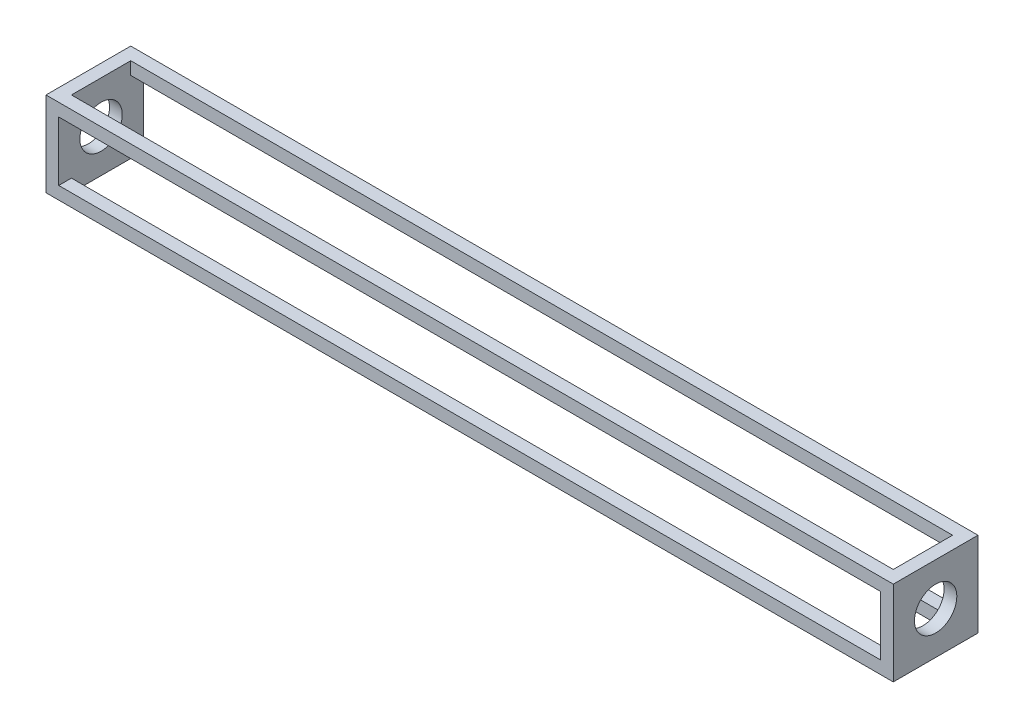
ISO-10303-21;
HEADER;
FILE_DESCRIPTION(('STEP AP214'),'2;1');
FILE_NAME('part.step','',(''),(''),'','','');
FILE_SCHEMA(('AUTOMOTIVE_DESIGN { 1 0 10303 214 1 1 1 1 }'));
ENDSEC;
DATA;
#1=APPLICATION_CONTEXT('core data for automotive mechanical design processes');
#2=APPLICATION_PROTOCOL_DEFINITION('international standard','automotive_design',2000,#1);
#3=PRODUCT_CONTEXT('',#1,'mechanical');
#4=PRODUCT('Part','Part','',(#3));
#5=PRODUCT_RELATED_PRODUCT_CATEGORY('part','',(#4));
#6=PRODUCT_DEFINITION_FORMATION('','',#4);
#7=PRODUCT_DEFINITION_CONTEXT('part definition',#1,'design');
#8=PRODUCT_DEFINITION('design','',#6,#7);
#9=PRODUCT_DEFINITION_SHAPE('','',#8);
#10=(LENGTH_UNIT() NAMED_UNIT(*) SI_UNIT(.MILLI.,.METRE.));
#11=(NAMED_UNIT(*) PLANE_ANGLE_UNIT() SI_UNIT($,.RADIAN.));
#12=(NAMED_UNIT(*) SI_UNIT($,.STERADIAN.) SOLID_ANGLE_UNIT());
#13=UNCERTAINTY_MEASURE_WITH_UNIT(LENGTH_MEASURE(1.E-05),#10,'distance_accuracy_value','');
#14=(GEOMETRIC_REPRESENTATION_CONTEXT(3) GLOBAL_UNCERTAINTY_ASSIGNED_CONTEXT((#13)) GLOBAL_UNIT_ASSIGNED_CONTEXT((#10,
#11,#12)) REPRESENTATION_CONTEXT('',''));
#15=CARTESIAN_POINT('',(0.,0.,0.));
#16=DIRECTION('',(0.,0.,1.));
#17=DIRECTION('',(1.,0.,0.));
#18=AXIS2_PLACEMENT_3D('',#15,#16,#17);
#19=CARTESIAN_POINT('',(0.,3.,20.));
#20=DIRECTION('',(0.,1.,0.));
#21=DIRECTION('',(0.,0.,1.));
#22=AXIS2_PLACEMENT_3D('',#19,#20,#21);
#23=PLANE('',#22);
#24=DIRECTION('',(1.,0.,0.));
#25=VECTOR('',#24,1.);
#26=CARTESIAN_POINT('',(0.,3.,17.));
#27=LINE('',#26,#25);
#28=CARTESIAN_POINT('',(3.,3.,17.));
#29=VERTEX_POINT('',#28);
#30=CARTESIAN_POINT('',(197.,3.,17.));
#31=VERTEX_POINT('',#30);
#32=EDGE_CURVE('E240',#29,#31,#27,.T.);
#33=ORIENTED_EDGE('',*,*,#32,.F.);
#34=DIRECTION('',(0.,0.,-1.));
#35=VECTOR('',#34,1.);
#36=CARTESIAN_POINT('',(3.,3.,20.));
#37=LINE('',#36,#35);
#38=CARTESIAN_POINT('',(3.,3.,20.));
#39=VERTEX_POINT('',#38);
#40=EDGE_CURVE('E178',#39,#29,#37,.T.);
#41=ORIENTED_EDGE('',*,*,#40,.F.);
#42=DIRECTION('',(1.,0.,0.));
#43=VECTOR('',#42,1.);
#44=CARTESIAN_POINT('',(3.,3.,20.));
#45=LINE('',#44,#43);
#46=CARTESIAN_POINT('',(197.,3.,20.));
#47=VERTEX_POINT('',#46);
#48=EDGE_CURVE('E228',#39,#47,#45,.T.);
#49=ORIENTED_EDGE('',*,*,#48,.T.);
#50=DIRECTION('',(0.,0.,-1.));
#51=VECTOR('',#50,1.);
#52=CARTESIAN_POINT('',(197.,3.,20.));
#53=LINE('',#52,#51);
#54=EDGE_CURVE('E182',#47,#31,#53,.T.);
#55=ORIENTED_EDGE('',*,*,#54,.T.);
#56=EDGE_LOOP('',(#33,#41,#49,#55));
#57=FACE_BOUND('',#56,.T.);
#58=ADVANCED_FACE('F19',(#57),#23,.T.);
#59=CARTESIAN_POINT('',(0.,17.,20.));
#60=DIRECTION('',(0.,-1.,0.));
#61=DIRECTION('',(0.,0.,-1.));
#62=AXIS2_PLACEMENT_3D('',#59,#60,#61);
#63=PLANE('',#62);
#64=DIRECTION('',(-1.,0.,0.));
#65=VECTOR('',#64,1.);
#66=CARTESIAN_POINT('',(0.,17.,17.));
#67=LINE('',#66,#65);
#68=CARTESIAN_POINT('',(197.,17.,17.));
#69=VERTEX_POINT('',#68);
#70=CARTESIAN_POINT('',(3.,17.,17.));
#71=VERTEX_POINT('',#70);
#72=EDGE_CURVE('E242',#69,#71,#67,.T.);
#73=ORIENTED_EDGE('',*,*,#72,.F.);
#74=DIRECTION('',(0.,0.,-1.));
#75=VECTOR('',#74,1.);
#76=CARTESIAN_POINT('',(197.,17.,20.));
#77=LINE('',#76,#75);
#78=CARTESIAN_POINT('',(197.,17.,20.));
#79=VERTEX_POINT('',#78);
#80=EDGE_CURVE('E168',#79,#69,#77,.T.);
#81=ORIENTED_EDGE('',*,*,#80,.F.);
#82=DIRECTION('',(-1.,0.,0.));
#83=VECTOR('',#82,1.);
#84=CARTESIAN_POINT('',(197.,17.,20.));
#85=LINE('',#84,#83);
#86=CARTESIAN_POINT('',(3.,17.,20.));
#87=VERTEX_POINT('',#86);
#88=EDGE_CURVE('E234',#79,#87,#85,.T.);
#89=ORIENTED_EDGE('',*,*,#88,.T.);
#90=DIRECTION('',(0.,0.,-1.));
#91=VECTOR('',#90,1.);
#92=CARTESIAN_POINT('',(3.,17.,20.));
#93=LINE('',#92,#91);
#94=EDGE_CURVE('E174',#87,#71,#93,.T.);
#95=ORIENTED_EDGE('',*,*,#94,.T.);
#96=EDGE_LOOP('',(#73,#81,#89,#95));
#97=FACE_BOUND('',#96,.T.);
#98=ADVANCED_FACE('F270',(#97),#63,.T.);
#99=CARTESIAN_POINT('',(0.,20.,20.));
#100=DIRECTION('',(0.,0.,-1.));
#101=DIRECTION('',(-1.,0.,0.));
#102=AXIS2_PLACEMENT_3D('',#99,#100,#101);
#103=PLANE('',#102);
#104=DIRECTION('',(0.,-1.,0.));
#105=VECTOR('',#104,1.);
#106=CARTESIAN_POINT('',(0.,0.,20.));
#107=LINE('',#106,#105);
#108=CARTESIAN_POINT('',(0.,20.,20.));
#109=VERTEX_POINT('',#108);
#110=CARTESIAN_POINT('',(0.,0.,20.));
#111=VERTEX_POINT('',#110);
#112=EDGE_CURVE('E203',#109,#111,#107,.T.);
#113=ORIENTED_EDGE('',*,*,#112,.T.);
#114=DIRECTION('',(1.,0.,0.));
#115=VECTOR('',#114,1.);
#116=CARTESIAN_POINT('',(0.,0.,20.));
#117=LINE('',#116,#115);
#118=CARTESIAN_POINT('',(200.,0.,20.));
#119=VERTEX_POINT('',#118);
#120=EDGE_CURVE('E214',#111,#119,#117,.T.);
#121=ORIENTED_EDGE('',*,*,#120,.T.);
#122=DIRECTION('',(0.,1.,0.));
#123=VECTOR('',#122,1.);
#124=CARTESIAN_POINT('',(200.,0.,20.));
#125=LINE('',#124,#123);
#126=CARTESIAN_POINT('',(200.,20.,20.));
#127=VERTEX_POINT('',#126);
#128=EDGE_CURVE('E212',#119,#127,#125,.T.);
#129=ORIENTED_EDGE('',*,*,#128,.T.);
#130=DIRECTION('',(-1.,0.,0.));
#131=VECTOR('',#130,1.);
#132=CARTESIAN_POINT('',(0.,20.,20.));
#133=LINE('',#132,#131);
#134=EDGE_CURVE('E200',#127,#109,#133,.T.);
#135=ORIENTED_EDGE('',*,*,#134,.T.);
#136=EDGE_LOOP('',(#113,#121,#129,#135));
#137=FACE_BOUND('',#136,.T.);
#138=ORIENTED_EDGE('',*,*,#88,.F.);
#139=DIRECTION('',(0.,1.,0.));
#140=VECTOR('',#139,1.);
#141=CARTESIAN_POINT('',(197.,3.,20.));
#142=LINE('',#141,#140);
#143=EDGE_CURVE('E223',#47,#79,#142,.T.);
#144=ORIENTED_EDGE('',*,*,#143,.F.);
#145=ORIENTED_EDGE('',*,*,#48,.F.);
#146=DIRECTION('',(0.,-1.,0.));
#147=VECTOR('',#146,1.);
#148=CARTESIAN_POINT('',(3.,17.,20.));
#149=LINE('',#148,#147);
#150=EDGE_CURVE('E231',#87,#39,#149,.T.);
#151=ORIENTED_EDGE('',*,*,#150,.F.);
#152=EDGE_LOOP('',(#138,#144,#145,#151));
#153=FACE_BOUND('',#152,.T.);
#154=ADVANCED_FACE('F280',(#137,#153),#103,.F.);
#155=CARTESIAN_POINT('',(0.,20.,0.));
#156=DIRECTION('',(0.,0.,-1.));
#157=DIRECTION('',(-1.,0.,0.));
#158=AXIS2_PLACEMENT_3D('',#155,#156,#157);
#159=PLANE('',#158);
#160=DIRECTION('',(0.,-1.,0.));
#161=VECTOR('',#160,1.);
#162=CARTESIAN_POINT('',(0.,0.,0.));
#163=LINE('',#162,#161);
#164=CARTESIAN_POINT('',(0.,20.,0.));
#165=VERTEX_POINT('',#164);
#166=CARTESIAN_POINT('',(0.,0.,0.));
#167=VERTEX_POINT('',#166);
#168=EDGE_CURVE('E208',#165,#167,#163,.T.);
#169=ORIENTED_EDGE('',*,*,#168,.F.);
#170=DIRECTION('',(-1.,0.,0.));
#171=VECTOR('',#170,1.);
#172=CARTESIAN_POINT('',(0.,20.,0.));
#173=LINE('',#172,#171);
#174=CARTESIAN_POINT('',(200.,20.,0.));
#175=VERTEX_POINT('',#174);
#176=EDGE_CURVE('E201',#175,#165,#173,.T.);
#177=ORIENTED_EDGE('',*,*,#176,.F.);
#178=DIRECTION('',(0.,1.,0.));
#179=VECTOR('',#178,1.);
#180=CARTESIAN_POINT('',(200.,0.,0.));
#181=LINE('',#180,#179);
#182=CARTESIAN_POINT('',(200.,0.,0.));
#183=VERTEX_POINT('',#182);
#184=EDGE_CURVE('E204',#183,#175,#181,.T.);
#185=ORIENTED_EDGE('',*,*,#184,.F.);
#186=DIRECTION('',(1.,0.,0.));
#187=VECTOR('',#186,1.);
#188=CARTESIAN_POINT('',(0.,0.,0.));
#189=LINE('',#188,#187);
#190=EDGE_CURVE('E206',#167,#183,#189,.T.);
#191=ORIENTED_EDGE('',*,*,#190,.F.);
#192=EDGE_LOOP('',(#169,#177,#185,#191));
#193=FACE_BOUND('',#192,.T.);
#194=DIRECTION('',(0.,1.,0.));
#195=VECTOR('',#194,1.);
#196=CARTESIAN_POINT('',(197.,20.,0.));
#197=LINE('',#196,#195);
#198=CARTESIAN_POINT('',(197.,3.,0.));
#199=VERTEX_POINT('',#198);
#200=CARTESIAN_POINT('',(197.,17.,0.));
#201=VERTEX_POINT('',#200);
#202=EDGE_CURVE('E165',#199,#201,#197,.T.);
#203=ORIENTED_EDGE('',*,*,#202,.T.);
#204=DIRECTION('',(-1.,0.,0.));
#205=VECTOR('',#204,1.);
#206=CARTESIAN_POINT('',(0.,17.,0.));
#207=LINE('',#206,#205);
#208=CARTESIAN_POINT('',(3.,17.,0.));
#209=VERTEX_POINT('',#208);
#210=EDGE_CURVE('E138',#201,#209,#207,.T.);
#211=ORIENTED_EDGE('',*,*,#210,.T.);
#212=DIRECTION('',(0.,-1.,0.));
#213=VECTOR('',#212,1.);
#214=CARTESIAN_POINT('',(3.,20.,0.));
#215=LINE('',#214,#213);
#216=CARTESIAN_POINT('',(3.,3.,0.));
#217=VERTEX_POINT('',#216);
#218=EDGE_CURVE('E159',#209,#217,#215,.T.);
#219=ORIENTED_EDGE('',*,*,#218,.T.);
#220=DIRECTION('',(1.,0.,0.));
#221=VECTOR('',#220,1.);
#222=CARTESIAN_POINT('',(0.,3.,0.));
#223=LINE('',#222,#221);
#224=EDGE_CURVE('E162',#217,#199,#223,.T.);
#225=ORIENTED_EDGE('',*,*,#224,.T.);
#226=EDGE_LOOP('',(#203,#211,#219,#225));
#227=FACE_BOUND('',#226,.T.);
#228=ADVANCED_FACE('F295',(#193,#227),#159,.T.);
#229=CARTESIAN_POINT('',(3.,0.,20.));
#230=DIRECTION('',(1.,0.,0.));
#231=DIRECTION('',(0.,0.,-1.));
#232=AXIS2_PLACEMENT_3D('',#229,#230,#231);
#233=PLANE('',#232);
#234=CARTESIAN_POINT('',(3.,17.,3.));
#235=VERTEX_POINT('',#234);
#236=EDGE_CURVE('E147',#235,#209,#93,.T.);
#237=ORIENTED_EDGE('',*,*,#236,.F.);
#238=DIRECTION('',(0.,-1.,0.));
#239=VECTOR('',#238,1.);
#240=CARTESIAN_POINT('',(3.,37.,3.));
#241=LINE('',#240,#239);
#242=CARTESIAN_POINT('',(3.,20.,3.));
#243=VERTEX_POINT('',#242);
#244=EDGE_CURVE('E42',#243,#235,#241,.T.);
#245=ORIENTED_EDGE('',*,*,#244,.F.);
#246=DIRECTION('',(0.,0.,-1.));
#247=VECTOR('',#246,1.);
#248=CARTESIAN_POINT('',(3.,20.,20.));
#249=LINE('',#248,#247);
#250=CARTESIAN_POINT('',(3.,20.,17.));
#251=VERTEX_POINT('',#250);
#252=EDGE_CURVE('E11',#251,#243,#249,.T.);
#253=ORIENTED_EDGE('',*,*,#252,.F.);
#254=DIRECTION('',(0.,-1.,0.));
#255=VECTOR('',#254,1.);
#256=CARTESIAN_POINT('',(3.,37.,17.));
#257=LINE('',#256,#255);
#258=EDGE_CURVE('E256',#251,#71,#257,.T.);
#259=ORIENTED_EDGE('',*,*,#258,.T.);
#260=ORIENTED_EDGE('',*,*,#94,.F.);
#261=ORIENTED_EDGE('',*,*,#150,.T.);
#262=ORIENTED_EDGE('',*,*,#40,.T.);
#263=CARTESIAN_POINT('',(3.,0.,17.));
#264=VERTEX_POINT('',#263);
#265=EDGE_CURVE('E263',#29,#264,#257,.T.);
#266=ORIENTED_EDGE('',*,*,#265,.T.);
#267=DIRECTION('',(0.,0.,1.));
#268=VECTOR('',#267,1.);
#269=CARTESIAN_POINT('',(3.,0.,20.));
#270=LINE('',#269,#268);
#271=CARTESIAN_POINT('',(3.,0.,3.));
#272=VERTEX_POINT('',#271);
#273=EDGE_CURVE('E237',#272,#264,#270,.T.);
#274=ORIENTED_EDGE('',*,*,#273,.F.);
#275=CARTESIAN_POINT('',(3.,3.,3.));
#276=VERTEX_POINT('',#275);
#277=EDGE_CURVE('E148',#276,#272,#241,.T.);
#278=ORIENTED_EDGE('',*,*,#277,.F.);
#279=EDGE_CURVE('E177',#276,#217,#37,.T.);
#280=ORIENTED_EDGE('',*,*,#279,.T.);
#281=ORIENTED_EDGE('',*,*,#218,.F.);
#282=EDGE_LOOP('',(#237,#245,#253,#259,#260,#261,#262,#266,#274,#278,#280,#281));
#283=FACE_BOUND('',#282,.T.);
#284=CARTESIAN_POINT('',(3.,10.,10.));
#285=DIRECTION('',(1.,0.,0.));
#286=DIRECTION('',(0.,0.,-1.));
#287=AXIS2_PLACEMENT_3D('',#284,#285,#286);
#288=CIRCLE('',#287,5.);
#289=CARTESIAN_POINT('',(3.,10.,5.));
#290=VERTEX_POINT('',#289);
#291=EDGE_CURVE('E172',#290,#290,#288,.T.);
#292=ORIENTED_EDGE('',*,*,#291,.F.);
#293=EDGE_LOOP('',(#292));
#294=FACE_BOUND('',#293,.T.);
#295=ADVANCED_FACE('F142',(#283,#294),#233,.T.);
#296=DIRECTION('',(-1.,0.,0.));
#297=VECTOR('',#296,1.);
#298=CARTESIAN_POINT('',(0.,3.,3.));
#299=LINE('',#298,#297);
#300=CARTESIAN_POINT('',(197.,3.,3.));
#301=VERTEX_POINT('',#300);
#302=EDGE_CURVE('E250',#301,#276,#299,.T.);
#303=ORIENTED_EDGE('',*,*,#302,.F.);
#304=EDGE_CURVE('E181',#301,#199,#53,.T.);
#305=ORIENTED_EDGE('',*,*,#304,.T.);
#306=ORIENTED_EDGE('',*,*,#224,.F.);
#307=ORIENTED_EDGE('',*,*,#279,.F.);
#308=EDGE_LOOP('',(#303,#305,#306,#307));
#309=FACE_BOUND('',#308,.T.);
#310=ADVANCED_FACE('F292',(#309),#23,.T.);
#311=CARTESIAN_POINT('',(197.,0.,20.));
#312=DIRECTION('',(-1.,0.,0.));
#313=DIRECTION('',(0.,0.,1.));
#314=AXIS2_PLACEMENT_3D('',#311,#312,#313);
#315=PLANE('',#314);
#316=ORIENTED_EDGE('',*,*,#304,.F.);
#317=DIRECTION('',(0.,-1.,0.));
#318=VECTOR('',#317,1.);
#319=CARTESIAN_POINT('',(197.,37.,3.));
#320=LINE('',#319,#318);
#321=CARTESIAN_POINT('',(197.,0.,3.));
#322=VERTEX_POINT('',#321);
#323=EDGE_CURVE('E34',#301,#322,#320,.T.);
#324=ORIENTED_EDGE('',*,*,#323,.T.);
#325=DIRECTION('',(0.,0.,-1.));
#326=VECTOR('',#325,1.);
#327=CARTESIAN_POINT('',(197.,0.,20.));
#328=LINE('',#327,#326);
#329=CARTESIAN_POINT('',(197.,0.,17.));
#330=VERTEX_POINT('',#329);
#331=EDGE_CURVE('E247',#330,#322,#328,.T.);
#332=ORIENTED_EDGE('',*,*,#331,.F.);
#333=DIRECTION('',(0.,-1.,0.));
#334=VECTOR('',#333,1.);
#335=CARTESIAN_POINT('',(197.,37.,17.));
#336=LINE('',#335,#334);
#337=EDGE_CURVE('E259',#31,#330,#336,.T.);
#338=ORIENTED_EDGE('',*,*,#337,.F.);
#339=ORIENTED_EDGE('',*,*,#54,.F.);
#340=ORIENTED_EDGE('',*,*,#143,.T.);
#341=ORIENTED_EDGE('',*,*,#80,.T.);
#342=CARTESIAN_POINT('',(197.,20.,17.));
#343=VERTEX_POINT('',#342);
#344=EDGE_CURVE('E262',#343,#69,#336,.T.);
#345=ORIENTED_EDGE('',*,*,#344,.F.);
#346=DIRECTION('',(0.,0.,1.));
#347=VECTOR('',#346,1.);
#348=CARTESIAN_POINT('',(197.,20.,20.));
#349=LINE('',#348,#347);
#350=CARTESIAN_POINT('',(197.,20.,3.));
#351=VERTEX_POINT('',#350);
#352=EDGE_CURVE('E137',#351,#343,#349,.T.);
#353=ORIENTED_EDGE('',*,*,#352,.F.);
#354=CARTESIAN_POINT('',(197.,17.,3.));
#355=VERTEX_POINT('',#354);
#356=EDGE_CURVE('E133',#351,#355,#320,.T.);
#357=ORIENTED_EDGE('',*,*,#356,.T.);
#358=EDGE_CURVE('E185',#355,#201,#77,.T.);
#359=ORIENTED_EDGE('',*,*,#358,.T.);
#360=ORIENTED_EDGE('',*,*,#202,.F.);
#361=EDGE_LOOP('',(#316,#324,#332,#338,#339,#340,#341,#345,#353,#357,#359,#360));
#362=FACE_BOUND('',#361,.T.);
#363=CARTESIAN_POINT('',(197.,10.,10.));
#364=DIRECTION('',(-1.,0.,0.));
#365=DIRECTION('',(0.,0.,1.));
#366=AXIS2_PLACEMENT_3D('',#363,#364,#365);
#367=CIRCLE('',#366,5.);
#368=CARTESIAN_POINT('',(197.,10.,15.));
#369=VERTEX_POINT('',#368);
#370=EDGE_CURVE('E169',#369,#369,#367,.T.);
#371=ORIENTED_EDGE('',*,*,#370,.F.);
#372=EDGE_LOOP('',(#371));
#373=FACE_BOUND('',#372,.T.);
#374=ADVANCED_FACE('F272',(#362,#373),#315,.T.);
#375=DIRECTION('',(1.,0.,0.));
#376=VECTOR('',#375,1.);
#377=CARTESIAN_POINT('',(0.,17.,3.));
#378=LINE('',#377,#376);
#379=EDGE_CURVE('E252',#235,#355,#378,.T.);
#380=ORIENTED_EDGE('',*,*,#379,.F.);
#381=ORIENTED_EDGE('',*,*,#236,.T.);
#382=ORIENTED_EDGE('',*,*,#210,.F.);
#383=ORIENTED_EDGE('',*,*,#358,.F.);
#384=EDGE_LOOP('',(#380,#381,#382,#383));
#385=FACE_BOUND('',#384,.T.);
#386=ADVANCED_FACE('F21',(#385),#63,.T.);
#387=CARTESIAN_POINT('',(0.,10.,10.));
#388=DIRECTION('',(1.,0.,0.));
#389=DIRECTION('',(0.,0.,-1.));
#390=AXIS2_PLACEMENT_3D('',#387,#388,#389);
#391=CYLINDRICAL_SURFACE('',#390,5.);
#392=ORIENTED_EDGE('',*,*,#370,.T.);
#393=EDGE_LOOP('',(#392));
#394=FACE_BOUND('',#393,.T.);
#395=CARTESIAN_POINT('',(200.,10.,10.));
#396=DIRECTION('',(1.,0.,0.));
#397=DIRECTION('',(0.,0.,-1.));
#398=AXIS2_PLACEMENT_3D('',#395,#396,#397);
#399=CIRCLE('',#398,5.);
#400=CARTESIAN_POINT('',(200.,10.,5.));
#401=VERTEX_POINT('',#400);
#402=EDGE_CURVE('E220',#401,#401,#399,.T.);
#403=ORIENTED_EDGE('',*,*,#402,.T.);
#404=EDGE_LOOP('',(#403));
#405=FACE_BOUND('',#404,.T.);
#406=ADVANCED_FACE('F300',(#394,#405),#391,.F.);
#407=ORIENTED_EDGE('',*,*,#291,.T.);
#408=EDGE_LOOP('',(#407));
#409=FACE_BOUND('',#408,.T.);
#410=CARTESIAN_POINT('',(0.,10.,10.));
#411=DIRECTION('',(1.,0.,0.));
#412=DIRECTION('',(0.,0.,-1.));
#413=AXIS2_PLACEMENT_3D('',#410,#411,#412);
#414=CIRCLE('',#413,5.);
#415=CARTESIAN_POINT('',(0.,10.,5.));
#416=VERTEX_POINT('',#415);
#417=EDGE_CURVE('E173',#416,#416,#414,.T.);
#418=ORIENTED_EDGE('',*,*,#417,.F.);
#419=EDGE_LOOP('',(#418));
#420=FACE_BOUND('',#419,.T.);
#421=ADVANCED_FACE('F307',(#409,#420),#391,.F.);
#422=CARTESIAN_POINT('',(0.,0.,20.));
#423=DIRECTION('',(1.,0.,0.));
#424=DIRECTION('',(0.,0.,-1.));
#425=AXIS2_PLACEMENT_3D('',#422,#423,#424);
#426=PLANE('',#425);
#427=ORIENTED_EDGE('',*,*,#417,.T.);
#428=EDGE_LOOP('',(#427));
#429=FACE_BOUND('',#428,.T.);
#430=ORIENTED_EDGE('',*,*,#168,.T.);
#431=DIRECTION('',(0.,0.,-1.));
#432=VECTOR('',#431,1.);
#433=CARTESIAN_POINT('',(0.,0.,20.));
#434=LINE('',#433,#432);
#435=EDGE_CURVE('E188',#111,#167,#434,.T.);
#436=ORIENTED_EDGE('',*,*,#435,.F.);
#437=ORIENTED_EDGE('',*,*,#112,.F.);
#438=DIRECTION('',(0.,0.,-1.));
#439=VECTOR('',#438,1.);
#440=CARTESIAN_POINT('',(0.,20.,20.));
#441=LINE('',#440,#439);
#442=EDGE_CURVE('E197',#109,#165,#441,.T.);
#443=ORIENTED_EDGE('',*,*,#442,.T.);
#444=EDGE_LOOP('',(#430,#436,#437,#443));
#445=FACE_BOUND('',#444,.T.);
#446=ADVANCED_FACE('F329',(#429,#445),#426,.F.);
#447=CARTESIAN_POINT('',(0.,0.,20.));
#448=DIRECTION('',(0.,1.,0.));
#449=DIRECTION('',(0.,0.,1.));
#450=AXIS2_PLACEMENT_3D('',#447,#448,#449);
#451=PLANE('',#450);
#452=DIRECTION('',(-1.,0.,0.));
#453=VECTOR('',#452,1.);
#454=CARTESIAN_POINT('',(0.,0.,3.));
#455=LINE('',#454,#453);
#456=EDGE_CURVE('E254',#322,#272,#455,.T.);
#457=ORIENTED_EDGE('',*,*,#456,.T.);
#458=ORIENTED_EDGE('',*,*,#273,.T.);
#459=DIRECTION('',(1.,0.,0.));
#460=VECTOR('',#459,1.);
#461=CARTESIAN_POINT('',(0.,0.,17.));
#462=LINE('',#461,#460);
#463=EDGE_CURVE('E244',#264,#330,#462,.T.);
#464=ORIENTED_EDGE('',*,*,#463,.T.);
#465=ORIENTED_EDGE('',*,*,#331,.T.);
#466=EDGE_LOOP('',(#457,#458,#464,#465));
#467=FACE_BOUND('',#466,.T.);
#468=ORIENTED_EDGE('',*,*,#190,.T.);
#469=DIRECTION('',(0.,0.,-1.));
#470=VECTOR('',#469,1.);
#471=CARTESIAN_POINT('',(200.,0.,20.));
#472=LINE('',#471,#470);
#473=EDGE_CURVE('E191',#119,#183,#472,.T.);
#474=ORIENTED_EDGE('',*,*,#473,.F.);
#475=ORIENTED_EDGE('',*,*,#120,.F.);
#476=ORIENTED_EDGE('',*,*,#435,.T.);
#477=EDGE_LOOP('',(#468,#474,#475,#476));
#478=FACE_BOUND('',#477,.T.);
#479=ADVANCED_FACE('F286',(#467,#478),#451,.F.);
#480=CARTESIAN_POINT('',(200.,0.,20.));
#481=DIRECTION('',(-1.,0.,0.));
#482=DIRECTION('',(0.,0.,1.));
#483=AXIS2_PLACEMENT_3D('',#480,#481,#482);
#484=PLANE('',#483);
#485=ORIENTED_EDGE('',*,*,#402,.F.);
#486=EDGE_LOOP('',(#485));
#487=FACE_BOUND('',#486,.T.);
#488=ORIENTED_EDGE('',*,*,#184,.T.);
#489=DIRECTION('',(0.,0.,-1.));
#490=VECTOR('',#489,1.);
#491=CARTESIAN_POINT('',(200.,20.,20.));
#492=LINE('',#491,#490);
#493=EDGE_CURVE('E194',#127,#175,#492,.T.);
#494=ORIENTED_EDGE('',*,*,#493,.F.);
#495=ORIENTED_EDGE('',*,*,#128,.F.);
#496=ORIENTED_EDGE('',*,*,#473,.T.);
#497=EDGE_LOOP('',(#488,#494,#495,#496));
#498=FACE_BOUND('',#497,.T.);
#499=ADVANCED_FACE('F335',(#487,#498),#484,.F.);
#500=CARTESIAN_POINT('',(0.,20.,20.));
#501=DIRECTION('',(0.,-1.,0.));
#502=DIRECTION('',(0.,0.,-1.));
#503=AXIS2_PLACEMENT_3D('',#500,#501,#502);
#504=PLANE('',#503);
#505=DIRECTION('',(-1.,0.,0.));
#506=VECTOR('',#505,1.);
#507=CARTESIAN_POINT('',(0.,20.,17.));
#508=LINE('',#507,#506);
#509=EDGE_CURVE('E27',#343,#251,#508,.T.);
#510=ORIENTED_EDGE('',*,*,#509,.T.);
#511=ORIENTED_EDGE('',*,*,#252,.T.);
#512=DIRECTION('',(1.,0.,0.));
#513=VECTOR('',#512,1.);
#514=CARTESIAN_POINT('',(0.,20.,3.));
#515=LINE('',#514,#513);
#516=EDGE_CURVE('E130',#243,#351,#515,.T.);
#517=ORIENTED_EDGE('',*,*,#516,.T.);
#518=ORIENTED_EDGE('',*,*,#352,.T.);
#519=EDGE_LOOP('',(#510,#511,#517,#518));
#520=FACE_BOUND('',#519,.T.);
#521=ORIENTED_EDGE('',*,*,#176,.T.);
#522=ORIENTED_EDGE('',*,*,#442,.F.);
#523=ORIENTED_EDGE('',*,*,#134,.F.);
#524=ORIENTED_EDGE('',*,*,#493,.T.);
#525=EDGE_LOOP('',(#521,#522,#523,#524));
#526=FACE_BOUND('',#525,.T.);
#527=ADVANCED_FACE('F151',(#520,#526),#504,.F.);
#528=CARTESIAN_POINT('',(3.,37.,3.));
#529=DIRECTION('',(0.,0.,-1.));
#530=DIRECTION('',(-1.,0.,0.));
#531=AXIS2_PLACEMENT_3D('',#528,#529,#530);
#532=PLANE('',#531);
#533=ORIENTED_EDGE('',*,*,#379,.T.);
#534=ORIENTED_EDGE('',*,*,#356,.F.);
#535=ORIENTED_EDGE('',*,*,#516,.F.);
#536=ORIENTED_EDGE('',*,*,#244,.T.);
#537=EDGE_LOOP('',(#533,#534,#535,#536));
#538=FACE_BOUND('',#537,.T.);
#539=ADVANCED_FACE('F131',(#538),#532,.F.);
#540=CARTESIAN_POINT('',(197.,37.,17.));
#541=DIRECTION('',(0.,0.,1.));
#542=DIRECTION('',(1.,0.,0.));
#543=AXIS2_PLACEMENT_3D('',#540,#541,#542);
#544=PLANE('',#543);
#545=ORIENTED_EDGE('',*,*,#72,.T.);
#546=ORIENTED_EDGE('',*,*,#258,.F.);
#547=ORIENTED_EDGE('',*,*,#509,.F.);
#548=ORIENTED_EDGE('',*,*,#344,.T.);
#549=EDGE_LOOP('',(#545,#546,#547,#548));
#550=FACE_BOUND('',#549,.T.);
#551=ADVANCED_FACE('F267',(#550),#544,.F.);
#552=ORIENTED_EDGE('',*,*,#32,.T.);
#553=ORIENTED_EDGE('',*,*,#337,.T.);
#554=ORIENTED_EDGE('',*,*,#463,.F.);
#555=ORIENTED_EDGE('',*,*,#265,.F.);
#556=EDGE_LOOP('',(#552,#553,#554,#555));
#557=FACE_BOUND('',#556,.T.);
#558=ADVANCED_FACE('F284',(#557),#544,.F.);
#559=ORIENTED_EDGE('',*,*,#302,.T.);
#560=ORIENTED_EDGE('',*,*,#277,.T.);
#561=ORIENTED_EDGE('',*,*,#456,.F.);
#562=ORIENTED_EDGE('',*,*,#323,.F.);
#563=EDGE_LOOP('',(#559,#560,#561,#562));
#564=FACE_BOUND('',#563,.T.);
#565=ADVANCED_FACE('F344',(#564),#532,.F.);
#566=CLOSED_SHELL('',(#58,#98,#154,#228,#295,#310,#374,#386,#406,#421,#446,#479,#499,#527,#539,
#551,#558,#565));
#567=MANIFOLD_SOLID_BREP('B1',#566);
#568=ADVANCED_BREP_SHAPE_REPRESENTATION('',(#18,#567),#14);
#569=SHAPE_DEFINITION_REPRESENTATION(#9,#568);
ENDSEC;
END-ISO-10303-21;
